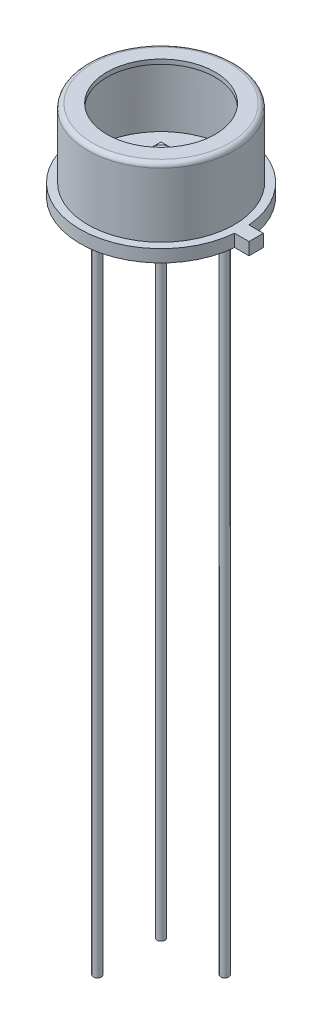
ISO-10303-21;
HEADER;
FILE_DESCRIPTION(('STEP AP214'),'2;1');
FILE_NAME('part.step','',(''),(''),'','','');
FILE_SCHEMA(('AUTOMOTIVE_DESIGN { 1 0 10303 214 1 1 1 1 }'));
ENDSEC;
DATA;
#1=APPLICATION_CONTEXT('core data for automotive mechanical design processes');
#2=APPLICATION_PROTOCOL_DEFINITION('international standard','automotive_design',2000,#1);
#3=PRODUCT_CONTEXT('',#1,'mechanical');
#4=PRODUCT('Part','Part','',(#3));
#5=PRODUCT_RELATED_PRODUCT_CATEGORY('part','',(#4));
#6=PRODUCT_DEFINITION_FORMATION('','',#4);
#7=PRODUCT_DEFINITION_CONTEXT('part definition',#1,'design');
#8=PRODUCT_DEFINITION('design','',#6,#7);
#9=PRODUCT_DEFINITION_SHAPE('','',#8);
#10=(LENGTH_UNIT() NAMED_UNIT(*) SI_UNIT(.MILLI.,.METRE.));
#11=(NAMED_UNIT(*) PLANE_ANGLE_UNIT() SI_UNIT($,.RADIAN.));
#12=(NAMED_UNIT(*) SI_UNIT($,.STERADIAN.) SOLID_ANGLE_UNIT());
#13=UNCERTAINTY_MEASURE_WITH_UNIT(LENGTH_MEASURE(1.E-05),#10,'distance_accuracy_value','');
#14=(GEOMETRIC_REPRESENTATION_CONTEXT(3) GLOBAL_UNCERTAINTY_ASSIGNED_CONTEXT((#13)) GLOBAL_UNIT_ASSIGNED_CONTEXT((#10,
#11,#12)) REPRESENTATION_CONTEXT('',''));
#15=CARTESIAN_POINT('',(0.,0.,0.));
#16=DIRECTION('',(0.,0.,1.));
#17=DIRECTION('',(1.,0.,0.));
#18=AXIS2_PLACEMENT_3D('',#15,#16,#17);
#19=CARTESIAN_POINT('',(-0.6,2.0792,-0.6));
#20=DIRECTION('',(0.,-1.,0.));
#21=DIRECTION('',(0.,0.,-1.));
#22=AXIS2_PLACEMENT_3D('',#19,#20,#21);
#23=PLANE('',#22);
#24=DIRECTION('',(0.,0.,-1.));
#25=VECTOR('',#24,1.);
#26=CARTESIAN_POINT('',(-0.6,2.0792,0.6));
#27=LINE('',#26,#25);
#28=CARTESIAN_POINT('',(-0.6,2.0792,0.6));
#29=VERTEX_POINT('',#28);
#30=CARTESIAN_POINT('',(-0.6,2.0792,-0.6));
#31=VERTEX_POINT('',#30);
#32=EDGE_CURVE('E117',#29,#31,#27,.T.);
#33=ORIENTED_EDGE('',*,*,#32,.F.);
#34=DIRECTION('',(-1.,0.,0.));
#35=VECTOR('',#34,1.);
#36=CARTESIAN_POINT('',(-0.6,2.0792,0.6));
#37=LINE('',#36,#35);
#38=CARTESIAN_POINT('',(0.6,2.0792,0.6));
#39=VERTEX_POINT('',#38);
#40=EDGE_CURVE('E90',#39,#29,#37,.T.);
#41=ORIENTED_EDGE('',*,*,#40,.F.);
#42=DIRECTION('',(0.,0.,1.));
#43=VECTOR('',#42,1.);
#44=CARTESIAN_POINT('',(0.6,2.0792,0.6));
#45=LINE('',#44,#43);
#46=CARTESIAN_POINT('',(0.6,2.0792,-0.6));
#47=VERTEX_POINT('',#46);
#48=EDGE_CURVE('E84',#47,#39,#45,.T.);
#49=ORIENTED_EDGE('',*,*,#48,.F.);
#50=DIRECTION('',(1.,0.,0.));
#51=VECTOR('',#50,1.);
#52=CARTESIAN_POINT('',(-0.6,2.0792,-0.6));
#53=LINE('',#52,#51);
#54=EDGE_CURVE('E108',#31,#47,#53,.T.);
#55=ORIENTED_EDGE('',*,*,#54,.F.);
#56=EDGE_LOOP('',(#33,#41,#49,#55));
#57=FACE_BOUND('',#56,.T.);
#58=CARTESIAN_POINT('',(0.,2.0792,0.));
#59=DIRECTION('',(0.,-1.,0.));
#60=DIRECTION('',(0.,0.,-1.));
#61=AXIS2_PLACEMENT_3D('',#58,#59,#60);
#62=CIRCLE('',#61,0.51);
#63=CARTESIAN_POINT('',(0.,2.0792,-0.51));
#64=VERTEX_POINT('',#63);
#65=EDGE_CURVE('E12',#64,#64,#62,.F.);
#66=ORIENTED_EDGE('',*,*,#65,.F.);
#67=EDGE_LOOP('',(#66));
#68=FACE_BOUND('',#67,.T.);
#69=ADVANCED_FACE('F50',(#57,#68),#23,.F.);
#70=CARTESIAN_POINT('',(-0.6,2.0292,0.6));
#71=DIRECTION('',(1.,0.,0.));
#72=DIRECTION('',(0.,0.,-1.));
#73=AXIS2_PLACEMENT_3D('',#70,#71,#72);
#74=PLANE('',#73);
#75=ORIENTED_EDGE('',*,*,#32,.T.);
#76=DIRECTION('',(0.,1.,0.));
#77=VECTOR('',#76,1.);
#78=CARTESIAN_POINT('',(-0.6,2.0292,-0.6));
#79=LINE('',#78,#77);
#80=CARTESIAN_POINT('',(-0.6,2.0292,-0.6));
#81=VERTEX_POINT('',#80);
#82=EDGE_CURVE('E59',#81,#31,#79,.T.);
#83=ORIENTED_EDGE('',*,*,#82,.F.);
#84=DIRECTION('',(0.,0.,-1.));
#85=VECTOR('',#84,1.);
#86=CARTESIAN_POINT('',(-0.6,2.0292,0.6));
#87=LINE('',#86,#85);
#88=CARTESIAN_POINT('',(-0.6,2.0292,0.6));
#89=VERTEX_POINT('',#88);
#90=EDGE_CURVE('E103',#89,#81,#87,.T.);
#91=ORIENTED_EDGE('',*,*,#90,.F.);
#92=DIRECTION('',(0.,1.,0.));
#93=VECTOR('',#92,1.);
#94=CARTESIAN_POINT('',(-0.6,2.0292,0.6));
#95=LINE('',#94,#93);
#96=EDGE_CURVE('E113',#89,#29,#95,.T.);
#97=ORIENTED_EDGE('',*,*,#96,.T.);
#98=EDGE_LOOP('',(#75,#83,#91,#97));
#99=FACE_BOUND('',#98,.T.);
#100=ADVANCED_FACE('F52',(#99),#74,.F.);
#101=CARTESIAN_POINT('',(-0.6,2.0292,-0.6));
#102=DIRECTION('',(0.,0.,1.));
#103=DIRECTION('',(1.,0.,0.));
#104=AXIS2_PLACEMENT_3D('',#101,#102,#103);
#105=PLANE('',#104);
#106=ORIENTED_EDGE('',*,*,#54,.T.);
#107=DIRECTION('',(0.,1.,0.));
#108=VECTOR('',#107,1.);
#109=CARTESIAN_POINT('',(0.6,2.0292,-0.6));
#110=LINE('',#109,#108);
#111=CARTESIAN_POINT('',(0.6,2.0292,-0.6));
#112=VERTEX_POINT('',#111);
#113=EDGE_CURVE('E106',#112,#47,#110,.T.);
#114=ORIENTED_EDGE('',*,*,#113,.F.);
#115=DIRECTION('',(1.,0.,0.));
#116=VECTOR('',#115,1.);
#117=CARTESIAN_POINT('',(-0.6,2.0292,-0.6));
#118=LINE('',#117,#116);
#119=EDGE_CURVE('E98',#81,#112,#118,.T.);
#120=ORIENTED_EDGE('',*,*,#119,.F.);
#121=ORIENTED_EDGE('',*,*,#82,.T.);
#122=EDGE_LOOP('',(#106,#114,#120,#121));
#123=FACE_BOUND('',#122,.T.);
#124=ADVANCED_FACE('F107',(#123),#105,.F.);
#125=CARTESIAN_POINT('',(0.6,2.0292,0.6));
#126=DIRECTION('',(-1.,0.,0.));
#127=DIRECTION('',(0.,0.,1.));
#128=AXIS2_PLACEMENT_3D('',#125,#126,#127);
#129=PLANE('',#128);
#130=ORIENTED_EDGE('',*,*,#48,.T.);
#131=DIRECTION('',(0.,1.,0.));
#132=VECTOR('',#131,1.);
#133=CARTESIAN_POINT('',(0.6,2.0292,0.6));
#134=LINE('',#133,#132);
#135=CARTESIAN_POINT('',(0.6,2.0292,0.6));
#136=VERTEX_POINT('',#135);
#137=EDGE_CURVE('E109',#136,#39,#134,.T.);
#138=ORIENTED_EDGE('',*,*,#137,.F.);
#139=DIRECTION('',(0.,0.,1.));
#140=VECTOR('',#139,1.);
#141=CARTESIAN_POINT('',(0.6,2.0292,0.6));
#142=LINE('',#141,#140);
#143=EDGE_CURVE('E101',#112,#136,#142,.T.);
#144=ORIENTED_EDGE('',*,*,#143,.F.);
#145=ORIENTED_EDGE('',*,*,#113,.T.);
#146=EDGE_LOOP('',(#130,#138,#144,#145));
#147=FACE_BOUND('',#146,.T.);
#148=ADVANCED_FACE('F111',(#147),#129,.F.);
#149=CARTESIAN_POINT('',(-0.6,2.0292,0.6));
#150=DIRECTION('',(0.,0.,-1.));
#151=DIRECTION('',(-1.,0.,0.));
#152=AXIS2_PLACEMENT_3D('',#149,#150,#151);
#153=PLANE('',#152);
#154=ORIENTED_EDGE('',*,*,#40,.T.);
#155=ORIENTED_EDGE('',*,*,#96,.F.);
#156=DIRECTION('',(-1.,0.,0.));
#157=VECTOR('',#156,1.);
#158=CARTESIAN_POINT('',(-0.6,2.0292,0.6));
#159=LINE('',#158,#157);
#160=EDGE_CURVE('E67',#136,#89,#159,.T.);
#161=ORIENTED_EDGE('',*,*,#160,.F.);
#162=ORIENTED_EDGE('',*,*,#137,.T.);
#163=EDGE_LOOP('',(#154,#155,#161,#162));
#164=FACE_BOUND('',#163,.T.);
#165=ADVANCED_FACE('F144',(#164),#153,.F.);
#166=CARTESIAN_POINT('',(-0.6,2.0292,-0.6));
#167=DIRECTION('',(0.,-1.,0.));
#168=DIRECTION('',(0.,0.,-1.));
#169=AXIS2_PLACEMENT_3D('',#166,#167,#168);
#170=PLANE('',#169);
#171=ORIENTED_EDGE('',*,*,#90,.T.);
#172=ORIENTED_EDGE('',*,*,#119,.T.);
#173=ORIENTED_EDGE('',*,*,#143,.T.);
#174=ORIENTED_EDGE('',*,*,#160,.T.);
#175=EDGE_LOOP('',(#171,#172,#173,#174));
#176=FACE_BOUND('',#175,.T.);
#177=ADVANCED_FACE('F99',(#176),#170,.T.);
#178=CARTESIAN_POINT('',(0.,2.1792,0.));
#179=DIRECTION('',(0.,-1.,0.));
#180=DIRECTION('',(0.,0.,-1.));
#181=AXIS2_PLACEMENT_3D('',#178,#179,#180);
#182=CYLINDRICAL_SURFACE('',#181,0.51);
#183=CARTESIAN_POINT('',(0.,2.1792,0.));
#184=DIRECTION('',(0.,1.,0.));
#185=DIRECTION('',(0.,0.,1.));
#186=AXIS2_PLACEMENT_3D('',#183,#184,#185);
#187=CIRCLE('',#186,0.51);
#188=CARTESIAN_POINT('',(0.,2.1792,0.51));
#189=VERTEX_POINT('',#188);
#190=EDGE_CURVE('E120',#189,#189,#187,.T.);
#191=ORIENTED_EDGE('',*,*,#190,.F.);
#192=EDGE_LOOP('',(#191));
#193=FACE_BOUND('',#192,.T.);
#194=ORIENTED_EDGE('',*,*,#65,.T.);
#195=EDGE_LOOP('',(#194));
#196=FACE_BOUND('',#195,.T.);
#197=ADVANCED_FACE('F133',(#193,#196),#182,.T.);
#198=CARTESIAN_POINT('',(0.,2.1792,0.));
#199=DIRECTION('',(0.,1.,0.));
#200=DIRECTION('',(0.,0.,1.));
#201=AXIS2_PLACEMENT_3D('',#198,#199,#200);
#202=PLANE('',#201);
#203=ORIENTED_EDGE('',*,*,#190,.T.);
#204=EDGE_LOOP('',(#203));
#205=FACE_BOUND('',#204,.T.);
#206=ADVANCED_FACE('F135',(#205),#202,.T.);
#207=CLOSED_SHELL('',(#69,#100,#124,#148,#165,#177,#197,#206));
#208=MANIFOLD_SOLID_BREP('B2',#207);
#209=CARTESIAN_POINT('',(4.572,0.,0.));
#210=DIRECTION('',(0.,1.,0.));
#211=DIRECTION('',(0.,0.,1.));
#212=AXIS2_PLACEMENT_3D('',#209,#210,#211);
#213=PLANE('',#212);
#214=CARTESIAN_POINT('',(1.79605122421383,0.,-1.79605122421383));
#215=DIRECTION('',(0.,1.,0.));
#216=DIRECTION('',(0.,0.,1.));
#217=AXIS2_PLACEMENT_3D('',#214,#215,#216);
#218=CIRCLE('',#217,0.225);
#219=CARTESIAN_POINT('',(1.79605122421383,0.,-1.57105122421383));
#220=VERTEX_POINT('',#219);
#221=EDGE_CURVE('E219',#220,#220,#218,.F.);
#222=ORIENTED_EDGE('',*,*,#221,.F.);
#223=EDGE_LOOP('',(#222));
#224=FACE_BOUND('',#223,.T.);
#225=CARTESIAN_POINT('',(0.,0.,0.));
#226=DIRECTION('',(0.,-1.,0.));
#227=DIRECTION('',(0.,0.,-1.));
#228=AXIS2_PLACEMENT_3D('',#225,#226,#227);
#229=CIRCLE('',#228,4.572);
#230=CARTESIAN_POINT('',(4.55402667976375,0.,0.405));
#231=VERTEX_POINT('',#230);
#232=CARTESIAN_POINT('',(4.55402667976374,0.,-0.405));
#233=VERTEX_POINT('',#232);
#234=EDGE_CURVE('E309',#231,#233,#229,.T.);
#235=ORIENTED_EDGE('',*,*,#234,.T.);
#236=DIRECTION('',(1.,0.,0.));
#237=VECTOR('',#236,1.);
#238=CARTESIAN_POINT('',(5.36402667976374,0.,-0.405));
#239=LINE('',#238,#237);
#240=CARTESIAN_POINT('',(5.36402667976374,0.,-0.405));
#241=VERTEX_POINT('',#240);
#242=EDGE_CURVE('E279',#233,#241,#239,.T.);
#243=ORIENTED_EDGE('',*,*,#242,.T.);
#244=DIRECTION('',(0.,0.,1.));
#245=VECTOR('',#244,1.);
#246=CARTESIAN_POINT('',(5.36402667976374,0.,-0.405));
#247=LINE('',#246,#245);
#248=CARTESIAN_POINT('',(5.36402667976374,0.,0.405));
#249=VERTEX_POINT('',#248);
#250=EDGE_CURVE('E264',#241,#249,#247,.T.);
#251=ORIENTED_EDGE('',*,*,#250,.T.);
#252=DIRECTION('',(-1.,0.,0.));
#253=VECTOR('',#252,1.);
#254=CARTESIAN_POINT('',(5.36402667976374,0.,0.405));
#255=LINE('',#254,#253);
#256=EDGE_CURVE('E226',#249,#231,#255,.T.);
#257=ORIENTED_EDGE('',*,*,#256,.T.);
#258=EDGE_LOOP('',(#235,#243,#251,#257));
#259=FACE_BOUND('',#258,.T.);
#260=CARTESIAN_POINT('',(-1.79605122421383,0.,-1.79605122421383));
#261=DIRECTION('',(0.,1.,0.));
#262=DIRECTION('',(0.,0.,1.));
#263=AXIS2_PLACEMENT_3D('',#260,#261,#262);
#264=CIRCLE('',#263,0.225);
#265=CARTESIAN_POINT('',(-1.79605122421383,0.,-1.57105122421383));
#266=VERTEX_POINT('',#265);
#267=EDGE_CURVE('E320',#266,#266,#264,.F.);
#268=ORIENTED_EDGE('',*,*,#267,.F.);
#269=EDGE_LOOP('',(#268));
#270=FACE_BOUND('',#269,.T.);
#271=CARTESIAN_POINT('',(-1.79605122421383,0.,1.79605122421383));
#272=DIRECTION('',(0.,1.,0.));
#273=DIRECTION('',(0.,0.,1.));
#274=AXIS2_PLACEMENT_3D('',#271,#272,#273);
#275=CIRCLE('',#274,0.225);
#276=CARTESIAN_POINT('',(-1.79605122421383,0.,2.02105122421383));
#277=VERTEX_POINT('',#276);
#278=EDGE_CURVE('E48',#277,#277,#275,.F.);
#279=ORIENTED_EDGE('',*,*,#278,.F.);
#280=EDGE_LOOP('',(#279));
#281=FACE_BOUND('',#280,.T.);
#282=ADVANCED_FACE('F211',(#224,#259,#270,#281),#213,.F.);
#283=CARTESIAN_POINT('',(3.876,4.572,0.));
#284=DIRECTION('',(0.,1.,0.));
#285=DIRECTION('',(0.,0.,1.));
#286=AXIS2_PLACEMENT_3D('',#283,#284,#285);
#287=PLANE('',#286);
#288=CARTESIAN_POINT('',(0.,4.572,0.));
#289=DIRECTION('',(0.,-1.,0.));
#290=DIRECTION('',(0.,0.,-1.));
#291=AXIS2_PLACEMENT_3D('',#288,#289,#290);
#292=CIRCLE('',#291,3.05);
#293=CARTESIAN_POINT('',(0.,4.572,-3.05));
#294=VERTEX_POINT('',#293);
#295=EDGE_CURVE('E317',#294,#294,#292,.T.);
#296=ORIENTED_EDGE('',*,*,#295,.T.);
#297=EDGE_LOOP('',(#296));
#298=FACE_BOUND('',#297,.T.);
#299=CARTESIAN_POINT('',(0.,4.572,0.));
#300=DIRECTION('',(0.,-1.,0.));
#301=DIRECTION('',(0.,0.,-1.));
#302=AXIS2_PLACEMENT_3D('',#299,#300,#301);
#303=CIRCLE('',#302,3.876);
#304=CARTESIAN_POINT('',(0.,4.572,-3.876));
#305=VERTEX_POINT('',#304);
#306=EDGE_CURVE('E298',#305,#305,#303,.T.);
#307=ORIENTED_EDGE('',*,*,#306,.F.);
#308=EDGE_LOOP('',(#307));
#309=FACE_BOUND('',#308,.T.);
#310=ADVANCED_FACE('F213',(#298,#309),#287,.T.);
#311=CARTESIAN_POINT('',(0.,0.,0.));
#312=DIRECTION('',(0.,-1.,0.));
#313=DIRECTION('',(0.,0.,-1.));
#314=AXIS2_PLACEMENT_3D('',#311,#312,#313);
#315=CYLINDRICAL_SURFACE('',#314,3.05);
#316=ORIENTED_EDGE('',*,*,#295,.F.);
#317=EDGE_LOOP('',(#316));
#318=FACE_BOUND('',#317,.T.);
#319=CARTESIAN_POINT('',(0.,4.318,0.));
#320=DIRECTION('',(0.,-1.,0.));
#321=DIRECTION('',(0.,0.,-1.));
#322=AXIS2_PLACEMENT_3D('',#319,#320,#321);
#323=CIRCLE('',#322,3.05);
#324=CARTESIAN_POINT('',(0.,4.318,-3.05));
#325=VERTEX_POINT('',#324);
#326=EDGE_CURVE('E314',#325,#325,#323,.T.);
#327=ORIENTED_EDGE('',*,*,#326,.T.);
#328=EDGE_LOOP('',(#327));
#329=FACE_BOUND('',#328,.T.);
#330=ADVANCED_FACE('F388',(#318,#329),#315,.F.);
#331=CARTESIAN_POINT('',(3.876,4.318,0.));
#332=DIRECTION('',(0.,1.,0.));
#333=DIRECTION('',(0.,0.,1.));
#334=AXIS2_PLACEMENT_3D('',#331,#332,#333);
#335=PLANE('',#334);
#336=ORIENTED_EDGE('',*,*,#326,.F.);
#337=EDGE_LOOP('',(#336));
#338=FACE_BOUND('',#337,.T.);
#339=CARTESIAN_POINT('',(0.,4.318,0.));
#340=DIRECTION('',(0.,-1.,0.));
#341=DIRECTION('',(0.,0.,-1.));
#342=AXIS2_PLACEMENT_3D('',#339,#340,#341);
#343=CIRCLE('',#342,3.876);
#344=CARTESIAN_POINT('',(0.,4.318,-3.876));
#345=VERTEX_POINT('',#344);
#346=EDGE_CURVE('E311',#345,#345,#343,.T.);
#347=ORIENTED_EDGE('',*,*,#346,.T.);
#348=EDGE_LOOP('',(#347));
#349=FACE_BOUND('',#348,.T.);
#350=ADVANCED_FACE('F385',(#338,#349),#335,.F.);
#351=CARTESIAN_POINT('',(0.,0.,0.));
#352=DIRECTION('',(0.,-1.,0.));
#353=DIRECTION('',(0.,0.,-1.));
#354=AXIS2_PLACEMENT_3D('',#351,#352,#353);
#355=CYLINDRICAL_SURFACE('',#354,3.876);
#356=ORIENTED_EDGE('',*,*,#346,.F.);
#357=EDGE_LOOP('',(#356));
#358=FACE_BOUND('',#357,.T.);
#359=CARTESIAN_POINT('',(0.,0.446,0.));
#360=DIRECTION('',(0.,1.,0.));
#361=DIRECTION('',(0.,0.,1.));
#362=AXIS2_PLACEMENT_3D('',#359,#360,#361);
#363=CIRCLE('',#362,3.876);
#364=CARTESIAN_POINT('',(0.,0.446,3.876));
#365=VERTEX_POINT('',#364);
#366=EDGE_CURVE('E295',#365,#365,#363,.F.);
#367=ORIENTED_EDGE('',*,*,#366,.T.);
#368=EDGE_LOOP('',(#367));
#369=FACE_BOUND('',#368,.T.);
#370=ADVANCED_FACE('F380',(#358,#369),#355,.F.);
#371=CARTESIAN_POINT('',(0.,0.,0.));
#372=DIRECTION('',(0.,-1.,0.));
#373=DIRECTION('',(0.,0.,-1.));
#374=AXIS2_PLACEMENT_3D('',#371,#372,#373);
#375=CYLINDRICAL_SURFACE('',#374,4.572);
#376=DIRECTION('',(0.,-1.,0.));
#377=VECTOR('',#376,1.);
#378=CARTESIAN_POINT('',(4.55402667976374,0.7,0.405));
#379=LINE('',#378,#377);
#380=CARTESIAN_POINT('',(4.55402667976374,0.7,0.405));
#381=VERTEX_POINT('',#380);
#382=EDGE_CURVE('E282',#381,#231,#379,.T.);
#383=ORIENTED_EDGE('',*,*,#382,.F.);
#384=CARTESIAN_POINT('',(0.,0.7,0.));
#385=DIRECTION('',(0.,-1.,0.));
#386=DIRECTION('',(0.,0.,-1.));
#387=AXIS2_PLACEMENT_3D('',#384,#385,#386);
#388=CIRCLE('',#387,4.572);
#389=CARTESIAN_POINT('',(4.55402667976374,0.7,-0.405));
#390=VERTEX_POINT('',#389);
#391=EDGE_CURVE('E307',#381,#390,#388,.T.);
#392=ORIENTED_EDGE('',*,*,#391,.T.);
#393=DIRECTION('',(0.,-1.,0.));
#394=VECTOR('',#393,1.);
#395=CARTESIAN_POINT('',(4.55402667976374,0.7,-0.405));
#396=LINE('',#395,#394);
#397=EDGE_CURVE('E257',#390,#233,#396,.T.);
#398=ORIENTED_EDGE('',*,*,#397,.T.);
#399=ORIENTED_EDGE('',*,*,#234,.F.);
#400=EDGE_LOOP('',(#383,#392,#398,#399));
#401=FACE_BOUND('',#400,.T.);
#402=ADVANCED_FACE('F378',(#401),#375,.T.);
#403=CARTESIAN_POINT('',(4.572,0.7,0.));
#404=DIRECTION('',(0.,1.,0.));
#405=DIRECTION('',(0.,0.,1.));
#406=AXIS2_PLACEMENT_3D('',#403,#404,#405);
#407=PLANE('',#406);
#408=ORIENTED_EDGE('',*,*,#391,.F.);
#409=DIRECTION('',(-1.,0.,0.));
#410=VECTOR('',#409,1.);
#411=CARTESIAN_POINT('',(5.36402667976374,0.7,0.405));
#412=LINE('',#411,#410);
#413=CARTESIAN_POINT('',(5.36402667976374,0.7,0.405));
#414=VERTEX_POINT('',#413);
#415=EDGE_CURVE('E234',#414,#381,#412,.T.);
#416=ORIENTED_EDGE('',*,*,#415,.F.);
#417=DIRECTION('',(0.,0.,1.));
#418=VECTOR('',#417,1.);
#419=CARTESIAN_POINT('',(5.36402667976374,0.7,-0.405));
#420=LINE('',#419,#418);
#421=CARTESIAN_POINT('',(5.36402667976374,0.7,-0.405));
#422=VERTEX_POINT('',#421);
#423=EDGE_CURVE('E263',#422,#414,#420,.T.);
#424=ORIENTED_EDGE('',*,*,#423,.F.);
#425=DIRECTION('',(1.,0.,0.));
#426=VECTOR('',#425,1.);
#427=CARTESIAN_POINT('',(5.36402667976374,0.7,-0.405));
#428=LINE('',#427,#426);
#429=EDGE_CURVE('E271',#390,#422,#428,.T.);
#430=ORIENTED_EDGE('',*,*,#429,.F.);
#431=EDGE_LOOP('',(#408,#416,#424,#430));
#432=FACE_BOUND('',#431,.T.);
#433=CARTESIAN_POINT('',(0.,0.7,0.));
#434=DIRECTION('',(0.,-1.,0.));
#435=DIRECTION('',(0.,0.,-1.));
#436=AXIS2_PLACEMENT_3D('',#433,#434,#435);
#437=CIRCLE('',#436,4.13);
#438=CARTESIAN_POINT('',(0.,0.7,-4.13));
#439=VERTEX_POINT('',#438);
#440=EDGE_CURVE('E304',#439,#439,#437,.T.);
#441=ORIENTED_EDGE('',*,*,#440,.T.);
#442=EDGE_LOOP('',(#441));
#443=FACE_BOUND('',#442,.T.);
#444=ADVANCED_FACE('F269',(#432,#443),#407,.T.);
#445=CARTESIAN_POINT('',(0.,0.,0.));
#446=DIRECTION('',(0.,-1.,0.));
#447=DIRECTION('',(0.,0.,-1.));
#448=AXIS2_PLACEMENT_3D('',#445,#446,#447);
#449=CYLINDRICAL_SURFACE('',#448,4.13);
#450=CARTESIAN_POINT('',(0.,4.318,0.));
#451=DIRECTION('',(0.,-1.,0.));
#452=DIRECTION('',(0.,0.,-1.));
#453=AXIS2_PLACEMENT_3D('',#450,#451,#452);
#454=CIRCLE('',#453,4.13);
#455=CARTESIAN_POINT('',(0.,4.318,-4.13));
#456=VERTEX_POINT('',#455);
#457=EDGE_CURVE('E301',#456,#456,#454,.T.);
#458=ORIENTED_EDGE('',*,*,#457,.T.);
#459=EDGE_LOOP('',(#458));
#460=FACE_BOUND('',#459,.T.);
#461=ORIENTED_EDGE('',*,*,#440,.F.);
#462=EDGE_LOOP('',(#461));
#463=FACE_BOUND('',#462,.T.);
#464=ADVANCED_FACE('F371',(#460,#463),#449,.T.);
#465=CARTESIAN_POINT('',(0.,4.318,0.));
#466=DIRECTION('',(0.,-1.,0.));
#467=DIRECTION('',(0.,0.,-1.));
#468=AXIS2_PLACEMENT_3D('',#465,#466,#467);
#469=TOROIDAL_SURFACE('',#468,3.876,0.254);
#470=ORIENTED_EDGE('',*,*,#306,.T.);
#471=EDGE_LOOP('',(#470));
#472=FACE_BOUND('',#471,.T.);
#473=ORIENTED_EDGE('',*,*,#457,.F.);
#474=EDGE_LOOP('',(#473));
#475=FACE_BOUND('',#474,.T.);
#476=ADVANCED_FACE('F367',(#472,#475),#469,.T.);
#477=CARTESIAN_POINT('',(4.572,0.446,0.));
#478=DIRECTION('',(0.,1.,0.));
#479=DIRECTION('',(0.,0.,1.));
#480=AXIS2_PLACEMENT_3D('',#477,#478,#479);
#481=PLANE('',#480);
#482=ORIENTED_EDGE('',*,*,#366,.F.);
#483=EDGE_LOOP('',(#482));
#484=FACE_BOUND('',#483,.T.);
#485=ADVANCED_FACE('F363',(#484),#481,.T.);
#486=CARTESIAN_POINT('',(-1.79605122421383,-38.,-1.79605122421383));
#487=DIRECTION('',(0.,1.,0.));
#488=DIRECTION('',(0.,0.,1.));
#489=AXIS2_PLACEMENT_3D('',#486,#487,#488);
#490=CYLINDRICAL_SURFACE('',#489,0.225);
#491=CARTESIAN_POINT('',(-1.79605122421383,-38.,-1.79605122421383));
#492=DIRECTION('',(0.,-1.,0.));
#493=DIRECTION('',(0.,0.,-1.));
#494=AXIS2_PLACEMENT_3D('',#491,#492,#493);
#495=CIRCLE('',#494,0.225);
#496=CARTESIAN_POINT('',(-1.79605122421383,-38.,-2.02105122421383));
#497=VERTEX_POINT('',#496);
#498=EDGE_CURVE('E292',#497,#497,#495,.T.);
#499=ORIENTED_EDGE('',*,*,#498,.F.);
#500=EDGE_LOOP('',(#499));
#501=FACE_BOUND('',#500,.T.);
#502=ORIENTED_EDGE('',*,*,#267,.T.);
#503=EDGE_LOOP('',(#502));
#504=FACE_BOUND('',#503,.T.);
#505=ADVANCED_FACE('F359',(#501,#504),#490,.T.);
#506=CARTESIAN_POINT('',(-1.79605122421383,-38.,-1.79605122421383));
#507=DIRECTION('',(0.,-1.,0.));
#508=DIRECTION('',(0.,0.,-1.));
#509=AXIS2_PLACEMENT_3D('',#506,#507,#508);
#510=PLANE('',#509);
#511=ORIENTED_EDGE('',*,*,#498,.T.);
#512=EDGE_LOOP('',(#511));
#513=FACE_BOUND('',#512,.T.);
#514=ADVANCED_FACE('F355',(#513),#510,.T.);
#515=CARTESIAN_POINT('',(1.79605122421383,-38.,-1.79605122421383));
#516=DIRECTION('',(0.,1.,0.));
#517=DIRECTION('',(0.,0.,1.));
#518=AXIS2_PLACEMENT_3D('',#515,#516,#517);
#519=CYLINDRICAL_SURFACE('',#518,0.225);
#520=CARTESIAN_POINT('',(1.79605122421383,-38.,-1.79605122421383));
#521=DIRECTION('',(0.,-1.,0.));
#522=DIRECTION('',(0.,0.,1.));
#523=AXIS2_PLACEMENT_3D('',#520,#521,#522);
#524=CIRCLE('',#523,0.225);
#525=CARTESIAN_POINT('',(1.79605122421383,-38.,-1.57105122421383));
#526=VERTEX_POINT('',#525);
#527=EDGE_CURVE('E289',#526,#526,#524,.T.);
#528=ORIENTED_EDGE('',*,*,#527,.F.);
#529=EDGE_LOOP('',(#528));
#530=FACE_BOUND('',#529,.T.);
#531=ORIENTED_EDGE('',*,*,#221,.T.);
#532=EDGE_LOOP('',(#531));
#533=FACE_BOUND('',#532,.T.);
#534=ADVANCED_FACE('F325',(#530,#533),#519,.T.);
#535=CARTESIAN_POINT('',(1.79605122421383,-38.,-1.79605122421383));
#536=DIRECTION('',(0.,1.,0.));
#537=DIRECTION('',(0.,0.,1.));
#538=AXIS2_PLACEMENT_3D('',#535,#536,#537);
#539=PLANE('',#538);
#540=ORIENTED_EDGE('',*,*,#527,.T.);
#541=EDGE_LOOP('',(#540));
#542=FACE_BOUND('',#541,.T.);
#543=ADVANCED_FACE('F338',(#542),#539,.F.);
#544=CARTESIAN_POINT('',(-1.79605122421383,-38.,1.79605122421383));
#545=DIRECTION('',(0.,1.,0.));
#546=DIRECTION('',(0.,0.,1.));
#547=AXIS2_PLACEMENT_3D('',#544,#545,#546);
#548=CYLINDRICAL_SURFACE('',#547,0.225);
#549=CARTESIAN_POINT('',(-1.79605122421383,-38.,1.79605122421383));
#550=DIRECTION('',(0.,-1.,0.));
#551=DIRECTION('',(0.,0.,-1.));
#552=AXIS2_PLACEMENT_3D('',#549,#550,#551);
#553=CIRCLE('',#552,0.225);
#554=CARTESIAN_POINT('',(-1.79605122421383,-38.,1.57105122421383));
#555=VERTEX_POINT('',#554);
#556=EDGE_CURVE('E284',#555,#555,#553,.T.);
#557=ORIENTED_EDGE('',*,*,#556,.F.);
#558=EDGE_LOOP('',(#557));
#559=FACE_BOUND('',#558,.T.);
#560=ORIENTED_EDGE('',*,*,#278,.T.);
#561=EDGE_LOOP('',(#560));
#562=FACE_BOUND('',#561,.T.);
#563=ADVANCED_FACE('F335',(#559,#562),#548,.T.);
#564=CARTESIAN_POINT('',(-1.79605122421383,-38.,1.79605122421383));
#565=DIRECTION('',(0.,-1.,0.));
#566=DIRECTION('',(0.,0.,-1.));
#567=AXIS2_PLACEMENT_3D('',#564,#565,#566);
#568=PLANE('',#567);
#569=ORIENTED_EDGE('',*,*,#556,.T.);
#570=EDGE_LOOP('',(#569));
#571=FACE_BOUND('',#570,.T.);
#572=ADVANCED_FACE('F337',(#571),#568,.T.);
#573=CARTESIAN_POINT('',(5.36402667976374,0.7,0.405));
#574=DIRECTION('',(0.,0.,1.));
#575=DIRECTION('',(1.,0.,0.));
#576=AXIS2_PLACEMENT_3D('',#573,#574,#575);
#577=PLANE('',#576);
#578=ORIENTED_EDGE('',*,*,#256,.F.);
#579=DIRECTION('',(0.,-1.,0.));
#580=VECTOR('',#579,1.);
#581=CARTESIAN_POINT('',(5.36402667976374,0.7,0.405));
#582=LINE('',#581,#580);
#583=EDGE_CURVE('E251',#414,#249,#582,.T.);
#584=ORIENTED_EDGE('',*,*,#583,.F.);
#585=ORIENTED_EDGE('',*,*,#415,.T.);
#586=ORIENTED_EDGE('',*,*,#382,.T.);
#587=EDGE_LOOP('',(#578,#584,#585,#586));
#588=FACE_BOUND('',#587,.T.);
#589=ADVANCED_FACE('F345',(#588),#577,.T.);
#590=CARTESIAN_POINT('',(5.36402667976374,0.7,-0.405));
#591=DIRECTION('',(1.,0.,0.));
#592=DIRECTION('',(0.,0.,-1.));
#593=AXIS2_PLACEMENT_3D('',#590,#591,#592);
#594=PLANE('',#593);
#595=ORIENTED_EDGE('',*,*,#250,.F.);
#596=DIRECTION('',(0.,-1.,0.));
#597=VECTOR('',#596,1.);
#598=CARTESIAN_POINT('',(5.36402667976374,0.7,-0.405));
#599=LINE('',#598,#597);
#600=EDGE_CURVE('E260',#422,#241,#599,.T.);
#601=ORIENTED_EDGE('',*,*,#600,.F.);
#602=ORIENTED_EDGE('',*,*,#423,.T.);
#603=ORIENTED_EDGE('',*,*,#583,.T.);
#604=EDGE_LOOP('',(#595,#601,#602,#603));
#605=FACE_BOUND('',#604,.T.);
#606=ADVANCED_FACE('F262',(#605),#594,.T.);
#607=CARTESIAN_POINT('',(5.36402667976374,0.7,-0.405));
#608=DIRECTION('',(0.,0.,-1.));
#609=DIRECTION('',(-1.,0.,0.));
#610=AXIS2_PLACEMENT_3D('',#607,#608,#609);
#611=PLANE('',#610);
#612=ORIENTED_EDGE('',*,*,#242,.F.);
#613=ORIENTED_EDGE('',*,*,#397,.F.);
#614=ORIENTED_EDGE('',*,*,#429,.T.);
#615=ORIENTED_EDGE('',*,*,#600,.T.);
#616=EDGE_LOOP('',(#612,#613,#614,#615));
#617=FACE_BOUND('',#616,.T.);
#618=ADVANCED_FACE('F274',(#617),#611,.T.);
#619=CLOSED_SHELL('',(#282,#310,#330,#350,#370,#402,#444,#464,#476,#485,#505,#514,#534,#543,
#563,#572,#589,#606,#618));
#620=MANIFOLD_SOLID_BREP('B6',#619);
#621=ADVANCED_BREP_SHAPE_REPRESENTATION('',(#18,#208,#620),#14);
#622=SHAPE_DEFINITION_REPRESENTATION(#9,#621);
ENDSEC;
END-ISO-10303-21;
